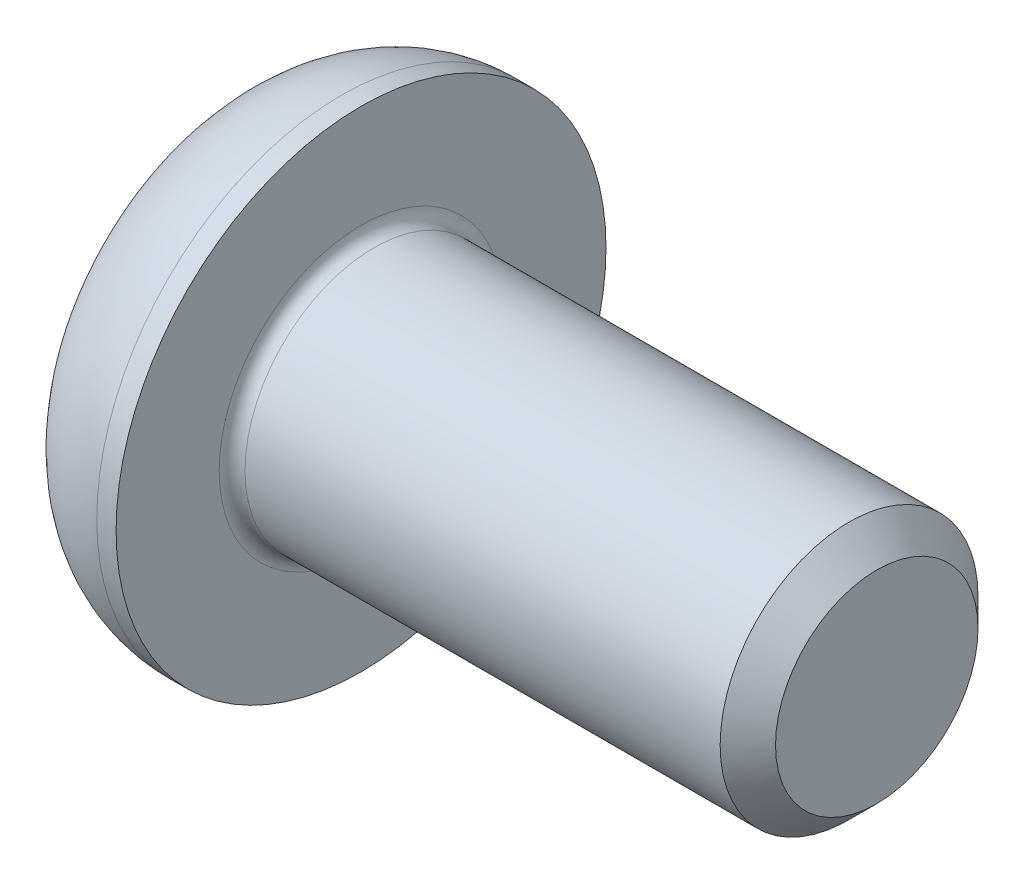
ISO-10303-21;
HEADER;
FILE_DESCRIPTION(('STEP AP214'),'2;1');
FILE_NAME('part.step','',(''),(''),'','','');
FILE_SCHEMA(('AUTOMOTIVE_DESIGN { 1 0 10303 214 1 1 1 1 }'));
ENDSEC;
DATA;
#1=APPLICATION_CONTEXT('core data for automotive mechanical design processes');
#2=APPLICATION_PROTOCOL_DEFINITION('international standard','automotive_design',2000,#1);
#3=PRODUCT_CONTEXT('',#1,'mechanical');
#4=PRODUCT('Part','Part','',(#3));
#5=PRODUCT_RELATED_PRODUCT_CATEGORY('part','',(#4));
#6=PRODUCT_DEFINITION_FORMATION('','',#4);
#7=PRODUCT_DEFINITION_CONTEXT('part definition',#1,'design');
#8=PRODUCT_DEFINITION('design','',#6,#7);
#9=PRODUCT_DEFINITION_SHAPE('','',#8);
#10=(LENGTH_UNIT() NAMED_UNIT(*) SI_UNIT(.MILLI.,.METRE.));
#11=(NAMED_UNIT(*) PLANE_ANGLE_UNIT() SI_UNIT($,.RADIAN.));
#12=(NAMED_UNIT(*) SI_UNIT($,.STERADIAN.) SOLID_ANGLE_UNIT());
#13=UNCERTAINTY_MEASURE_WITH_UNIT(LENGTH_MEASURE(1.E-05),#10,'distance_accuracy_value','');
#14=(GEOMETRIC_REPRESENTATION_CONTEXT(3) GLOBAL_UNCERTAINTY_ASSIGNED_CONTEXT((#13)) GLOBAL_UNIT_ASSIGNED_CONTEXT((#10,
#11,#12)) REPRESENTATION_CONTEXT('',''));
#15=CARTESIAN_POINT('',(0.,0.,0.));
#16=DIRECTION('',(0.,0.,1.));
#17=DIRECTION('',(1.,0.,0.));
#18=AXIS2_PLACEMENT_3D('',#15,#16,#17);
#19=CARTESIAN_POINT('',(-0.904999999875145,0.,0.));
#20=DIRECTION('',(-1.,0.,0.));
#21=DIRECTION('',(0.,0.,1.));
#22=AXIS2_PLACEMENT_3D('',#19,#20,#21);
#23=CONICAL_SURFACE('',#22,1.45203592671805,1.04719755115765);
#24=CARTESIAN_POINT('',(-0.0666666666973015,-5.6843418860808E-11,0.));
#25=VERTEX_POINT('',#24);
#26=VERTEX_LOOP('',#25);
#27=FACE_BOUND('',#26,.T.);
#28=CARTESIAN_POINT('',(-0.899999999895465,1.24999999991282,-0.721687836705776));
#29=CARTESIAN_POINT('',(-0.881684715662103,1.19507007013616,-0.753401646340966));
#30=CARTESIAN_POINT('',(-0.865027923174486,1.1396659860227,-0.785389209173815));
#31=CARTESIAN_POINT('',(-0.835953992139613,1.02789853317084,-0.84991817813204));
#32=CARTESIAN_POINT('',(-0.823547137724434,0.971533179187624,-0.882460730439183));
#33=CARTESIAN_POINT('',(-0.804234974358824,0.859500978788186,-0.947142551506237));
#34=CARTESIAN_POINT('',(-0.797201117271249,0.803851365133497,-0.979271870927009));
#35=CARTESIAN_POINT('',(-0.78880573011305,0.692290424620332,-1.04368160996113));
#36=CARTESIAN_POINT('',(-0.787437246268047,0.636379502977309,-1.07596179562322));
#37=CARTESIAN_POINT('',(-0.790291431384831,0.531915943877927,-1.13627385959031));
#38=CARTESIAN_POINT('',(-0.793813303298533,0.483347630813507,-1.16431478821198));
#39=CARTESIAN_POINT('',(-0.804973312984706,0.386527411401505,-1.22021396795239));
#40=CARTESIAN_POINT('',(-0.812615259263485,0.338275839679263,-1.24807202587511));
#41=CARTESIAN_POINT('',(-0.831718645861244,0.241256161485361,-1.30408636319712));
#42=CARTESIAN_POINT('',(-0.843261026405586,0.192500327968863,-1.33223555680244));
#43=CARTESIAN_POINT('',(-0.869457350530444,0.0957156438709913,-1.38811422021978));
#44=CARTESIAN_POINT('',(-0.884105142968317,0.0476855543224275,-1.41584440534985));
#45=CARTESIAN_POINT('',(-0.899999999989879,1.63995568404391E-10,-1.44337567287971));
#46=B_SPLINE_CURVE_WITH_KNOTS('',3,(#28,#29,#30,#31,#32,#33,#34,#35,#36,#37,#38,#39,#40,#41,#42,
#43,#44,#45),.UNSPECIFIED.,.F.,.F.,(4,2,2,2,2,2,2,2,4),(0.,0.198135007186097,0.396746135570628,
0.59044225374554,0.783900555431306,0.952317363947969,1.12089012085788,1.2932010137193,
1.4651737330377),.UNSPECIFIED.);
#47=CARTESIAN_POINT('',(-0.899999999950276,1.24999999980888,-0.721687836492175));
#48=VERTEX_POINT('',#47);
#49=CARTESIAN_POINT('',(-0.899999999982609,1.96257150938358E-12,-1.44337567286712));
#50=VERTEX_POINT('',#49);
#51=EDGE_CURVE('E103',#48,#50,#46,.T.);
#52=ORIENTED_EDGE('',*,*,#51,.T.);
#53=CARTESIAN_POINT('',(-0.899999999893595,-2.31072218817118E-10,-1.44337567300549));
#54=CARTESIAN_POINT('',(-0.881684715660365,-0.0549299299140426,-1.41166186320821));
#55=CARTESIAN_POINT('',(-0.86502792317278,-0.110334013989012,-1.3796743003089));
#56=CARTESIAN_POINT('',(-0.835953992137871,-0.222101466812513,-1.31514533130202));
#57=CARTESIAN_POINT('',(-0.823547137722625,-0.278466820805983,-1.28260277901289));
#58=CARTESIAN_POINT('',(-0.804234974356904,-0.390499021212521,-1.21792095795876));
#59=CARTESIAN_POINT('',(-0.797201117269277,-0.446148634864375,-1.18579163853346));
#60=CARTESIAN_POINT('',(-0.788805730110948,-0.557709575375265,-1.12138189949618));
#61=CARTESIAN_POINT('',(-0.787437246265866,-0.613620497018845,-1.08910171383544));
#62=CARTESIAN_POINT('',(-0.790291431382727,-0.718084056126904,-1.02878964986439));
#63=CARTESIAN_POINT('',(-0.793813303297357,-0.766652369199541,-1.00074872123762));
#64=CARTESIAN_POINT('',(-0.804973312986761,-0.863472588628037,-0.944849541487422));
#65=CARTESIAN_POINT('',(-0.812615259267848,-0.911724160358555,-0.916991483560017));
#66=CARTESIAN_POINT('',(-0.831718645871401,-1.00874383856915,-0.860977146228447));
#67=CARTESIAN_POINT('',(-0.843261026419272,-1.05749967209406,-0.832827952618252));
#68=CARTESIAN_POINT('',(-0.869457350551973,-1.15428435620845,-0.776949289191331));
#69=CARTESIAN_POINT('',(-0.884105142994157,-1.20231444576512,-0.749219104056564));
#70=CARTESIAN_POINT('',(-0.90000000002026,-1.24999999993156,-0.721687836522116));
#71=B_SPLINE_CURVE_WITH_KNOTS('',3,(#53,#54,#55,#56,#57,#58,#59,#60,#61,#62,#63,#64,#65,#66,#67,
#68,#69,#70),.UNSPECIFIED.,.F.,.F.,(4,2,2,2,2,2,2,2,4),(0.,0.198135007185751,0.396746135569964,
0.590442253744319,0.783900555429511,0.952317363975204,1.12089012091425,1.29320101380634,
1.46517373315516),.UNSPECIFIED.);
#72=CARTESIAN_POINT('',(-0.899999999987108,-1.24999999995633,-0.721687836364369));
#73=VERTEX_POINT('',#72);
#74=EDGE_CURVE('E134',#50,#73,#71,.T.);
#75=ORIENTED_EDGE('',*,*,#74,.T.);
#76=CARTESIAN_POINT('',(-0.899999999842174,-1.25000000019539,-0.721687836229798));
#77=CARTESIAN_POINT('',(-0.882896111075563,-1.24999999481034,-0.662444421267075));
#78=CARTESIAN_POINT('',(-0.867237014060793,-1.24999999738598,-0.602732338419685));
#79=CARTESIAN_POINT('',(-0.839561502195528,-1.25000000261982,-0.482338189350465));
#80=CARTESIAN_POINT('',(-0.827553237744171,-1.25000000527818,-0.421654266620353));
#81=CARTESIAN_POINT('',(-0.80824250364639,-1.24999999484458,-0.300967350520173));
#82=CARTESIAN_POINT('',(-0.800837076879798,-1.24999998211752,-0.240981348930731));
#83=CARTESIAN_POINT('',(-0.790895700381869,-1.25000001786304,-0.12066326676355));
#84=CARTESIAN_POINT('',(-0.788354464927657,-1.25000006626909,-0.0603316333839474));
#85=CARTESIAN_POINT('',(-0.788354464927002,-1.25000006626979,0.0603316333939961));
#86=CARTESIAN_POINT('',(-0.790895700382119,-1.25000001786444,0.120663266792337));
#87=CARTESIAN_POINT('',(-0.800837076887306,-1.24999998211612,0.240981348995787));
#88=CARTESIAN_POINT('',(-0.808242503660248,-1.24999999483968,0.30096735060276));
#89=CARTESIAN_POINT('',(-0.827553237762847,-1.25000000528321,0.421654266741162));
#90=CARTESIAN_POINT('',(-0.839561502212521,-1.25000000263868,0.48233818949201));
#91=CARTESIAN_POINT('',(-0.867237014115977,-1.24999999736716,0.602732338592252));
#92=CARTESIAN_POINT('',(-0.882896111170561,-1.24999999474013,0.662444421449944));
#93=CARTESIAN_POINT('',(-0.900000000022398,-1.25,0.72168783641098));
#94=B_SPLINE_CURVE_WITH_KNOTS('',3,(#76,#77,#78,#79,#80,#81,#82,#83,#84,#85,#86,#87,#88,#89,#90,
#91,#92,#93),.UNSPECIFIED.,.F.,.F.,(4,2,2,2,2,2,2,2,4),(0.,0.185045871632975,0.3705018706702,
0.551644291266182,0.732589759614196,0.913535228017753,1.09467764866905,1.28013364776468,
1.46517951945754),.UNSPECIFIED.);
#95=CARTESIAN_POINT('',(-0.899999999988181,-1.24999999987475,0.721687836509393));
#96=VERTEX_POINT('',#95);
#97=EDGE_CURVE('E274',#73,#96,#94,.T.);
#98=ORIENTED_EDGE('',*,*,#97,.T.);
#99=CARTESIAN_POINT('',(-0.899999999842517,-1.24999999987697,0.72168783678411));
#100=CARTESIAN_POINT('',(-0.881684715631303,-1.19507007008352,0.753401646392062));
#101=CARTESIAN_POINT('',(-0.865027923154306,-1.13966598596531,0.785389209212495));
#102=CARTESIAN_POINT('',(-0.835953992130203,-1.02789853311445,0.849918178159034));
#103=CARTESIAN_POINT('',(-0.823547137715168,-0.971533179136998,0.88246073046694));
#104=CARTESIAN_POINT('',(-0.804234974352029,-0.859500978745731,0.947142551532184));
#105=CARTESIAN_POINT('',(-0.797201117266771,-0.803851365093511,0.979271870950477));
#106=CARTESIAN_POINT('',(-0.78880573011195,-0.692290424586258,1.04368160998042));
#107=CARTESIAN_POINT('',(-0.787437246267998,-0.636379502946676,1.07596179564081));
#108=CARTESIAN_POINT('',(-0.79029143138629,-0.531915943852794,1.1362738596049));
#109=CARTESIAN_POINT('',(-0.793813303300584,-0.483347630790453,1.16431478822531));
#110=CARTESIAN_POINT('',(-0.804973312987493,-0.386527411382594,1.22021396796329));
#111=CARTESIAN_POINT('',(-0.812615259266423,-0.338275839662417,1.24807202588483));
#112=CARTESIAN_POINT('',(-0.831718645864065,-0.241256161473001,1.30408636320426));
#113=CARTESIAN_POINT('',(-0.843261026408104,-0.192500327958919,1.33223555680818));
#114=CARTESIAN_POINT('',(-0.869457350531995,-0.0957156438659012,1.38811422022272));
#115=CARTESIAN_POINT('',(-0.8841051429692,-0.0476855543197738,1.41584440535138));
#116=CARTESIAN_POINT('',(-0.899999999989963,-1.63745370551762E-10,1.44337567287986));
#117=B_SPLINE_CURVE_WITH_KNOTS('',3,(#99,#100,#101,#102,#103,#104,#105,#106,#107,#108,#109,#110,
#111,#112,#113,#114,#115,#116),.UNSPECIFIED.,.F.,.F.,(4,2,2,2,2,2,2,2,4),(0.,0.198135007172041,
0.396746135543351,0.590442253707212,0.783900555381576,0.952317363891064,1.120890120794,
1.29320101364705,1.4651737329568),.UNSPECIFIED.);
#118=CARTESIAN_POINT('',(-0.899999999982609,-1.69922761891508E-12,1.44337567286712));
#119=VERTEX_POINT('',#118);
#120=EDGE_CURVE('E269',#96,#119,#117,.T.);
#121=ORIENTED_EDGE('',*,*,#120,.T.);
#122=CARTESIAN_POINT('',(-0.899999999893449,2.31368758154919E-10,1.44337567300543));
#123=CARTESIAN_POINT('',(-0.881684715660276,0.0549299299142771,1.41166186320811));
#124=CARTESIAN_POINT('',(-0.865027923172723,0.110334013989197,1.3796743003088));
#125=CARTESIAN_POINT('',(-0.835953992137855,0.222101466812606,1.31514533130196));
#126=CARTESIAN_POINT('',(-0.823547137722618,0.278466820806033,1.28260277901286));
#127=CARTESIAN_POINT('',(-0.804234974356898,0.390499021212549,1.21792095795875));
#128=CARTESIAN_POINT('',(-0.79720111726927,0.446148634864426,1.18579163853343));
#129=CARTESIAN_POINT('',(-0.788805730110944,0.557709575375368,1.12138189949612));
#130=CARTESIAN_POINT('',(-0.787437246265865,0.613620497018976,1.08910171383536));
#131=CARTESIAN_POINT('',(-0.790291431382515,0.718084056119022,1.02878964986894));
#132=CARTESIAN_POINT('',(-0.793813303296201,0.766652369183635,1.00074872124681));
#133=CARTESIAN_POINT('',(-0.804973312982414,0.863472588596216,0.944849541505793));
#134=CARTESIAN_POINT('',(-0.81261525926125,0.911724160318843,0.916991483582945));
#135=CARTESIAN_POINT('',(-0.831718645859188,1.00874383851348,0.860977146260592));
#136=CARTESIAN_POINT('',(-0.843261026403653,1.05749967203032,0.832827952655053));
#137=CARTESIAN_POINT('',(-0.869457350528802,1.15428435612887,0.776949289237277));
#138=CARTESIAN_POINT('',(-0.884105142966843,1.20231444567776,0.749219104106998));
#139=CARTESIAN_POINT('',(-0.899999999988587,1.24999999983654,0.721687836576975));
#140=B_SPLINE_CURVE_WITH_KNOTS('',3,(#122,#123,#124,#125,#126,#127,#128,#129,#130,#131,#132,
#133,#134,#135,#136,#137,#138,#139),.UNSPECIFIED.,.F.,.F.,(4,2,2,2,2,2,2,2,4),(0.,
0.198135007185603,0.396746135569654,0.590442253744091,0.783900555429375,0.952317363947233,
1.12089012085834,1.29320101372104,1.4651737330407),.UNSPECIFIED.);
#141=CARTESIAN_POINT('',(-0.899999999982482,1.24999999990819,0.721687836431727));
#142=VERTEX_POINT('',#141);
#143=EDGE_CURVE('E106',#119,#142,#140,.T.);
#144=ORIENTED_EDGE('',*,*,#143,.T.);
#145=CARTESIAN_POINT('',(-0.899999999895439,1.25000000014505,0.721687836300142));
#146=CARTESIAN_POINT('',(-0.882896111105858,1.24999999479226,0.662444421335814));
#147=CARTESIAN_POINT('',(-0.867237014079879,1.24999999738113,0.6027323384837));
#148=CARTESIAN_POINT('',(-0.83956150220309,1.25000000262467,0.482338189402405));
#149=CARTESIAN_POINT('',(-0.827553237751427,1.25000000527947,0.42165426666494));
#150=CARTESIAN_POINT('',(-0.808242503651249,1.24999999484333,0.300967350551273));
#151=CARTESIAN_POINT('',(-0.800837076882572,1.24999998211718,0.240981348955692));
#152=CARTESIAN_POINT('',(-0.790895700382171,1.25000001786337,0.120663266775804));
#153=CARTESIAN_POINT('',(-0.788354464927581,1.25000006626918,0.0603316333896348));
#154=CARTESIAN_POINT('',(-0.788354464927077,1.2500000662697,-0.0603316333854344));
#155=CARTESIAN_POINT('',(-0.79089570038138,1.25000001786441,-0.120663266774334));
#156=CARTESIAN_POINT('',(-0.800837076883513,1.24999998211614,-0.240981348958975));
#157=CARTESIAN_POINT('',(-0.808242503654205,1.24999999483968,-0.300967350556579));
#158=CARTESIAN_POINT('',(-0.82755323775111,1.2500000052832,-0.421654266676448));
#159=CARTESIAN_POINT('',(-0.839561502197323,1.25000000263867,-0.482338189418136));
#160=CARTESIAN_POINT('',(-0.867237014093116,1.24999999736716,-0.602732338500565));
#161=CARTESIAN_POINT('',(-0.882896111143514,1.24999999474014,-0.662444421349601));
#162=CARTESIAN_POINT('',(-0.89999999999097,1.25,-0.721687836302114));
#163=B_SPLINE_CURVE_WITH_KNOTS('',3,(#145,#146,#147,#148,#149,#150,#151,#152,#153,#154,#155,
#156,#157,#158,#159,#160,#161,#162),.UNSPECIFIED.,.F.,.F.,(4,2,2,2,2,2,2,2,4),(0.,
0.185045871655127,0.370501870713738,0.551644291328948,0.732589759696517,0.913535228071817,
1.09467764869446,1.28013364776116,1.46517951942576),.UNSPECIFIED.);
#164=EDGE_CURVE('E99',#142,#48,#163,.T.);
#165=ORIENTED_EDGE('',*,*,#164,.T.);
#166=EDGE_LOOP('',(#52,#75,#98,#121,#144,#165));
#167=FACE_BOUND('',#166,.T.);
#168=ADVANCED_FACE('F17',(#27,#167),#23,.F.);
#169=CARTESIAN_POINT('',(-2.2,1.25,0.721687836487));
#170=DIRECTION('',(0.,1.,0.));
#171=DIRECTION('',(0.,0.,1.));
#172=AXIS2_PLACEMENT_3D('',#169,#170,#171);
#173=PLANE('',#172);
#174=ORIENTED_EDGE('',*,*,#164,.F.);
#175=DIRECTION('',(1.,0.,0.));
#176=VECTOR('',#175,1.);
#177=CARTESIAN_POINT('',(-2.2,1.2499999999981,0.721687836483702));
#178=LINE('',#177,#176);
#179=CARTESIAN_POINT('',(-2.2,1.24999999978205,0.721687836484204));
#180=VERTEX_POINT('',#179);
#181=EDGE_CURVE('E109',#142,#180,#178,.F.);
#182=ORIENTED_EDGE('',*,*,#181,.T.);
#183=DIRECTION('',(0.,0.,1.));
#184=VECTOR('',#183,1.);
#185=CARTESIAN_POINT('',(-2.2,1.24999999954,0.));
#186=LINE('',#185,#184);
#187=CARTESIAN_POINT('',(-2.2,1.24999999961776,-0.721687836707686));
#188=VERTEX_POINT('',#187);
#189=EDGE_CURVE('E115',#188,#180,#186,.T.);
#190=ORIENTED_EDGE('',*,*,#189,.F.);
#191=DIRECTION('',(1.,0.,0.));
#192=VECTOR('',#191,1.);
#193=CARTESIAN_POINT('',(-2.2,1.24999999961776,-0.721687836707686));
#194=LINE('',#193,#192);
#195=EDGE_CURVE('E112',#188,#48,#194,.T.);
#196=ORIENTED_EDGE('',*,*,#195,.T.);
#197=EDGE_LOOP('',(#174,#182,#190,#196));
#198=FACE_BOUND('',#197,.T.);
#199=ADVANCED_FACE('F113',(#198),#173,.F.);
#200=CARTESIAN_POINT('',(-2.2,0.,1.44337567297));
#201=DIRECTION('',(0.,0.50000000000019,0.866025403784329));
#202=DIRECTION('',(0.,-0.866025403784329,0.50000000000019));
#203=AXIS2_PLACEMENT_3D('',#200,#201,#202);
#204=PLANE('',#203);
#205=DIRECTION('',(1.,0.,0.));
#206=VECTOR('',#205,1.);
#207=CARTESIAN_POINT('',(-2.2,-1.90407585531904E-12,1.4433756729733));
#208=LINE('',#207,#206);
#209=CARTESIAN_POINT('',(-2.2,-1.83056522522186E-10,1.44337567308873));
#210=VERTEX_POINT('',#209);
#211=EDGE_CURVE('E267',#119,#210,#208,.F.);
#212=ORIENTED_EDGE('',*,*,#211,.T.);
#213=DIRECTION('',(0.,-0.866025403757106,0.500000000047341));
#214=VECTOR('',#213,1.);
#215=CARTESIAN_POINT('',(-2.2,1.24999999954,0.721687836573));
#216=LINE('',#215,#214);
#217=EDGE_CURVE('E123',#180,#210,#216,.T.);
#218=ORIENTED_EDGE('',*,*,#217,.F.);
#219=ORIENTED_EDGE('',*,*,#181,.F.);
#220=ORIENTED_EDGE('',*,*,#143,.F.);
#221=EDGE_LOOP('',(#212,#218,#219,#220));
#222=FACE_BOUND('',#221,.T.);
#223=ADVANCED_FACE('F397',(#222),#204,.F.);
#224=CARTESIAN_POINT('',(-2.2,-1.25,0.721687836487));
#225=DIRECTION('',(0.,-0.50000000000019,0.866025403784329));
#226=DIRECTION('',(0.,-0.866025403784329,-0.50000000000019));
#227=AXIS2_PLACEMENT_3D('',#224,#225,#226);
#228=PLANE('',#227);
#229=DIRECTION('',(1.,0.,0.));
#230=VECTOR('',#229,1.);
#231=CARTESIAN_POINT('',(-2.2,-1.25,0.721687836658));
#232=LINE('',#231,#230);
#233=CARTESIAN_POINT('',(-2.2,-1.25000000023,0.721687836560204));
#234=VERTEX_POINT('',#233);
#235=EDGE_CURVE('E272',#96,#234,#232,.F.);
#236=ORIENTED_EDGE('',*,*,#235,.T.);
#237=DIRECTION('',(0.,-0.86602540375779,-0.500000000046157));
#238=VECTOR('',#237,1.);
#239=CARTESIAN_POINT('',(-2.2,-4.58026845617798E-10,1.44337567315));
#240=LINE('',#239,#238);
#241=EDGE_CURVE('E240',#210,#234,#240,.T.);
#242=ORIENTED_EDGE('',*,*,#241,.F.);
#243=ORIENTED_EDGE('',*,*,#211,.F.);
#244=ORIENTED_EDGE('',*,*,#120,.F.);
#245=EDGE_LOOP('',(#236,#242,#243,#244));
#246=FACE_BOUND('',#245,.T.);
#247=ADVANCED_FACE('F389',(#246),#228,.F.);
#248=CARTESIAN_POINT('',(-2.2,-1.25,-0.721687836487));
#249=DIRECTION('',(0.,-1.,0.));
#250=DIRECTION('',(1.,0.,0.));
#251=AXIS2_PLACEMENT_3D('',#248,#249,#250);
#252=PLANE('',#251);
#253=ORIENTED_EDGE('',*,*,#97,.F.);
#254=DIRECTION('',(1.,0.,0.));
#255=VECTOR('',#254,1.);
#256=CARTESIAN_POINT('',(-2.2,-1.2500000001474,-0.7216878363975));
#257=LINE('',#256,#255);
#258=CARTESIAN_POINT('',(-2.2,-1.25000000019764,-0.721687836546482));
#259=VERTEX_POINT('',#258);
#260=EDGE_CURVE('E277',#73,#259,#257,.F.);
#261=ORIENTED_EDGE('',*,*,#260,.T.);
#262=DIRECTION('',(0.,0.,1.));
#263=VECTOR('',#262,1.);
#264=CARTESIAN_POINT('',(-2.2,-1.25000000046,0.));
#265=LINE('',#264,#263);
#266=EDGE_CURVE('E245',#234,#259,#265,.F.);
#267=ORIENTED_EDGE('',*,*,#266,.F.);
#268=ORIENTED_EDGE('',*,*,#235,.F.);
#269=EDGE_LOOP('',(#253,#261,#267,#268));
#270=FACE_BOUND('',#269,.T.);
#271=ADVANCED_FACE('F382',(#270),#252,.F.);
#272=CARTESIAN_POINT('',(-2.2,0.,-1.44337567297));
#273=DIRECTION('',(0.,-0.50000000000019,-0.866025403784329));
#274=DIRECTION('',(0.,0.866025403784329,-0.50000000000019));
#275=AXIS2_PLACEMENT_3D('',#272,#273,#274);
#276=PLANE('',#275);
#277=DIRECTION('',(1.,0.,0.));
#278=VECTOR('',#277,1.);
#279=CARTESIAN_POINT('',(-2.2,1.90385901488455E-12,-1.4433756729733));
#280=LINE('',#279,#278);
#281=CARTESIAN_POINT('',(-2.2,-1.03210382275768E-10,-1.44337567298957));
#282=VERTEX_POINT('',#281);
#283=EDGE_CURVE('E119',#50,#282,#280,.F.);
#284=ORIENTED_EDGE('',*,*,#283,.T.);
#285=DIRECTION('',(0.,0.86602540375779,-0.500000000046157));
#286=VECTOR('',#285,1.);
#287=CARTESIAN_POINT('',(-2.2,-1.25000000046,-0.721687836573));
#288=LINE('',#287,#286);
#289=EDGE_CURVE('E250',#259,#282,#288,.T.);
#290=ORIENTED_EDGE('',*,*,#289,.F.);
#291=ORIENTED_EDGE('',*,*,#260,.F.);
#292=ORIENTED_EDGE('',*,*,#74,.F.);
#293=EDGE_LOOP('',(#284,#290,#291,#292));
#294=FACE_BOUND('',#293,.T.);
#295=ADVANCED_FACE('F376',(#294),#276,.F.);
#296=CARTESIAN_POINT('',(-2.2,1.25,-0.721687836487));
#297=DIRECTION('',(0.,0.50000000000019,-0.866025403784329));
#298=DIRECTION('',(0.,0.866025403784329,0.50000000000019));
#299=AXIS2_PLACEMENT_3D('',#296,#297,#298);
#300=PLANE('',#299);
#301=ORIENTED_EDGE('',*,*,#195,.F.);
#302=DIRECTION('',(0.,0.866025403757106,0.500000000047341));
#303=VECTOR('',#302,1.);
#304=CARTESIAN_POINT('',(-2.2,-4.58026845617798E-10,-1.44337567315));
#305=LINE('',#304,#303);
#306=EDGE_CURVE('E255',#282,#188,#305,.T.);
#307=ORIENTED_EDGE('',*,*,#306,.F.);
#308=ORIENTED_EDGE('',*,*,#283,.F.);
#309=ORIENTED_EDGE('',*,*,#51,.F.);
#310=EDGE_LOOP('',(#301,#307,#308,#309));
#311=FACE_BOUND('',#310,.T.);
#312=ADVANCED_FACE('F121',(#311),#300,.F.);
#313=CARTESIAN_POINT('',(-2.2,2.62168783649,0.));
#314=DIRECTION('',(-1.,0.,0.));
#315=DIRECTION('',(0.,-1.,0.));
#316=AXIS2_PLACEMENT_3D('',#313,#314,#315);
#317=PLANE('',#316);
#318=ORIENTED_EDGE('',*,*,#289,.T.);
#319=ORIENTED_EDGE('',*,*,#306,.T.);
#320=ORIENTED_EDGE('',*,*,#189,.T.);
#321=ORIENTED_EDGE('',*,*,#217,.T.);
#322=ORIENTED_EDGE('',*,*,#241,.T.);
#323=ORIENTED_EDGE('',*,*,#266,.T.);
#324=EDGE_LOOP('',(#318,#319,#320,#321,#322,#323));
#325=FACE_BOUND('',#324,.T.);
#326=CARTESIAN_POINT('',(-2.2,0.,-1.9));
#327=CARTESIAN_POINT('',(-2.2,-0.36265690061289,-1.89979752619059));
#328=CARTESIAN_POINT('',(-2.2,-0.699379948167787,-1.76659777201864));
#329=CARTESIAN_POINT('',(-2.2,-1.06480278954368,-1.62204505133757));
#330=CARTESIAN_POINT('',(-2.2,-1.34350288425459,-1.34350288425459));
#331=CARTESIAN_POINT('',(-2.2,-1.6214575775046,-1.06570569624483));
#332=CARTESIAN_POINT('',(-2.2,-1.76659777201864,-0.699379948167787));
#333=CARTESIAN_POINT('',(-2.2,-1.89979722746393,-0.363191958873555));
#334=CARTESIAN_POINT('',(-2.2,-1.9,0.));
#335=B_SPLINE_CURVE_WITH_KNOTS('',2,(#326,#327,#328,#329,#330,#331,#332,#333,#334),
.UNSPECIFIED.,.F.,.F.,(3,2,2,2,3),(0.,0.25,0.5,0.75,1.),.UNSPECIFIED.);
#336=CARTESIAN_POINT('',(-2.2,0.,-1.9));
#337=VERTEX_POINT('',#336);
#338=CARTESIAN_POINT('',(-2.2,-1.9,0.));
#339=VERTEX_POINT('',#338);
#340=EDGE_CURVE('E287',#337,#339,#335,.T.);
#341=ORIENTED_EDGE('',*,*,#340,.T.);
#342=CARTESIAN_POINT('',(-2.2,-1.9,0.));
#343=CARTESIAN_POINT('',(-2.2,-1.89979752619059,0.362656900612583));
#344=CARTESIAN_POINT('',(-2.2,-1.76659777201864,0.699379948167787));
#345=CARTESIAN_POINT('',(-2.2,-1.62204505133753,1.06480278954412));
#346=CARTESIAN_POINT('',(-2.2,-1.34350288425459,1.34350288425459));
#347=CARTESIAN_POINT('',(-2.2,-1.06570569624445,1.62145757750459));
#348=CARTESIAN_POINT('',(-2.2,-0.699379948167787,1.76659777201864));
#349=CARTESIAN_POINT('',(-2.2,-0.36319195887394,1.89979722746393));
#350=CARTESIAN_POINT('',(-2.2,0.,1.9));
#351=B_SPLINE_CURVE_WITH_KNOTS('',2,(#342,#343,#344,#345,#346,#347,#348,#349,#350),
.UNSPECIFIED.,.F.,.F.,(3,2,2,2,3),(0.,0.25,0.5,0.75,1.),.UNSPECIFIED.);
#352=CARTESIAN_POINT('',(-2.2,0.,1.9));
#353=VERTEX_POINT('',#352);
#354=EDGE_CURVE('E284',#339,#353,#351,.T.);
#355=ORIENTED_EDGE('',*,*,#354,.T.);
#356=CARTESIAN_POINT('',(-2.2,0.,1.9));
#357=CARTESIAN_POINT('',(-2.2,0.362656900612794,1.89979752619059));
#358=CARTESIAN_POINT('',(-2.2,0.699379948167786,1.76659777201864));
#359=CARTESIAN_POINT('',(-2.2,1.06480278954374,1.62204505133758));
#360=CARTESIAN_POINT('',(-2.2,1.34350288425459,1.34350288425459));
#361=CARTESIAN_POINT('',(-2.2,1.62145757750463,1.06570569624472));
#362=CARTESIAN_POINT('',(-2.2,1.76659777201864,0.699379948167782));
#363=CARTESIAN_POINT('',(-2.2,1.89979722746393,0.363191958873572));
#364=CARTESIAN_POINT('',(-2.2,1.9,0.));
#365=B_SPLINE_CURVE_WITH_KNOTS('',2,(#356,#357,#358,#359,#360,#361,#362,#363,#364),
.UNSPECIFIED.,.F.,.F.,(3,2,2,2,3),(0.,0.25,0.5,0.75,1.),.UNSPECIFIED.);
#366=CARTESIAN_POINT('',(-2.2,1.9,0.));
#367=VERTEX_POINT('',#366);
#368=EDGE_CURVE('E259',#353,#367,#365,.T.);
#369=ORIENTED_EDGE('',*,*,#368,.T.);
#370=CARTESIAN_POINT('',(-2.2,1.9,0.));
#371=CARTESIAN_POINT('',(-2.2,1.89979752619059,-0.36265690061314));
#372=CARTESIAN_POINT('',(-2.2,1.76659777201864,-0.699379948167792));
#373=CARTESIAN_POINT('',(-2.2,1.62204505133735,-1.06480278954399));
#374=CARTESIAN_POINT('',(-2.2,1.34350288425459,-1.34350288425459));
#375=CARTESIAN_POINT('',(-2.2,1.06570569624542,-1.62145757750393));
#376=CARTESIAN_POINT('',(-2.2,0.699379948167788,-1.76659777201864));
#377=CARTESIAN_POINT('',(-2.2,0.363191958874567,-1.89979722746393));
#378=CARTESIAN_POINT('',(-2.2,0.,-1.9));
#379=B_SPLINE_CURVE_WITH_KNOTS('',2,(#370,#371,#372,#373,#374,#375,#376,#377,#378),
.UNSPECIFIED.,.F.,.F.,(3,2,2,2,3),(0.,0.25,0.5,0.75,1.),.UNSPECIFIED.);
#380=EDGE_CURVE('E305',#367,#337,#379,.T.);
#381=ORIENTED_EDGE('',*,*,#380,.T.);
#382=EDGE_LOOP('',(#341,#355,#369,#381));
#383=FACE_BOUND('',#382,.T.);
#384=ADVANCED_FACE('F290',(#325,#383),#317,.T.);
#385=CARTESIAN_POINT('',(-0.3,0.,0.));
#386=DIRECTION('',(1.,0.,0.));
#387=DIRECTION('',(0.,0.,-1.));
#388=AXIS2_PLACEMENT_3D('',#385,#386,#387);
#389=DEGENERATE_TOROIDAL_SURFACE('',#388,1.9,1.90000000000007,.T.);
#390=CARTESIAN_POINT('',(-0.3,0.,0.));
#391=DIRECTION('',(1.,0.,0.));
#392=DIRECTION('',(0.,0.,-1.));
#393=AXIS2_PLACEMENT_3D('',#390,#391,#392);
#394=CIRCLE('',#393,3.8);
#395=CARTESIAN_POINT('',(-0.3,0.,-3.8));
#396=VERTEX_POINT('',#395);
#397=EDGE_CURVE('E308',#396,#396,#394,.T.);
#398=ORIENTED_EDGE('',*,*,#397,.F.);
#399=EDGE_LOOP('',(#398));
#400=FACE_BOUND('',#399,.T.);
#401=ORIENTED_EDGE('',*,*,#380,.F.);
#402=ORIENTED_EDGE('',*,*,#368,.F.);
#403=ORIENTED_EDGE('',*,*,#354,.F.);
#404=ORIENTED_EDGE('',*,*,#340,.F.);
#405=EDGE_LOOP('',(#401,#402,#403,#404));
#406=FACE_BOUND('',#405,.T.);
#407=ADVANCED_FACE('F19',(#400,#406),#389,.T.);
#408=CARTESIAN_POINT('',(-1.1,0.,0.));
#409=DIRECTION('',(1.,0.,0.));
#410=DIRECTION('',(0.,0.,-1.));
#411=AXIS2_PLACEMENT_3D('',#408,#409,#410);
#412=CYLINDRICAL_SURFACE('',#411,3.8);
#413=ORIENTED_EDGE('',*,*,#397,.T.);
#414=EDGE_LOOP('',(#413));
#415=FACE_BOUND('',#414,.T.);
#416=CARTESIAN_POINT('',(0.,0.,0.));
#417=DIRECTION('',(1.,0.,0.));
#418=DIRECTION('',(0.,0.,-1.));
#419=AXIS2_PLACEMENT_3D('',#416,#417,#418);
#420=CIRCLE('',#419,3.8);
#421=CARTESIAN_POINT('',(0.,0.,-3.8));
#422=VERTEX_POINT('',#421);
#423=EDGE_CURVE('E132',#422,#422,#420,.T.);
#424=ORIENTED_EDGE('',*,*,#423,.F.);
#425=EDGE_LOOP('',(#424));
#426=FACE_BOUND('',#425,.T.);
#427=ADVANCED_FACE('F201',(#415,#426),#412,.T.);
#428=CARTESIAN_POINT('',(0.,2.9,0.));
#429=DIRECTION('',(1.,0.,0.));
#430=DIRECTION('',(0.,1.,0.));
#431=AXIS2_PLACEMENT_3D('',#428,#429,#430);
#432=PLANE('',#431);
#433=CARTESIAN_POINT('',(0.,0.,0.));
#434=DIRECTION('',(1.,0.,0.));
#435=DIRECTION('',(0.,0.,1.));
#436=AXIS2_PLACEMENT_3D('',#433,#434,#435);
#437=CIRCLE('',#436,2.2);
#438=CARTESIAN_POINT('',(0.,-2.2,0.));
#439=VERTEX_POINT('',#438);
#440=CARTESIAN_POINT('',(0.,0.,2.2));
#441=VERTEX_POINT('',#440);
#442=EDGE_CURVE('E219',#439,#441,#437,.F.);
#443=ORIENTED_EDGE('',*,*,#442,.T.);
#444=CARTESIAN_POINT('',(0.,2.2,0.));
#445=CARTESIAN_POINT('',(2.59485219284629E-09,2.19998575154874,0.0307475517317676));
#446=CARTESIAN_POINT('',(1.81769915502313E-09,2.19933455898998,0.0614948549161519));
#447=CARTESIAN_POINT('',(-1.18157776646753E-10,2.19676157840836,0.122934729205102));
#448=CARTESIAN_POINT('',(-1.27684271321729E-09,2.19483985351,0.153627302952858));
#449=CARTESIAN_POINT('',(2.38564244641518E-09,2.18972916496953,0.214905757204253));
#450=CARTESIAN_POINT('',(7.206658026358E-09,2.18654023407363,0.245491640444308));
#451=CARTESIAN_POINT('',(4.27781037659395E-08,2.17889884798254,0.306505997739295));
#452=CARTESIAN_POINT('',(7.35284820468544E-08,2.17444639531538,0.336934472109042));
#453=CARTESIAN_POINT('',(1.73591454626332E-07,2.16683112781648,0.38241870801543));
#454=CARTESIAN_POINT('',(2.15937663297943E-07,2.164136501512,0.397554210627282));
#455=CARTESIAN_POINT('',(3.11082697393704E-07,2.15843235202415,0.427741458892821));
#456=CARTESIAN_POINT('',(3.63865186029653E-07,2.15542332442782,0.442793298123176));
#457=CARTESIAN_POINT('',(4.98662459445389E-07,2.14590969967549,0.487844204128152));
#458=CARTESIAN_POINT('',(5.57143956349478E-07,2.13891800198918,0.51774201553623));
#459=CARTESIAN_POINT('',(5.8019872945562E-07,2.12365058896836,0.577202730744742));
#460=CARTESIAN_POINT('',(5.44782594325254E-07,2.11537501851295,0.606765671930331));
#461=CARTESIAN_POINT('',(3.95827864921428E-07,2.09757534103425,0.66550932321324));
#462=CARTESIAN_POINT('',(2.82302068252502E-07,2.0880514387464,0.694690095127757));
#463=CARTESIAN_POINT('',(9.51522408654276E-08,2.06769565514402,0.75258394329037));
#464=CARTESIAN_POINT('',(2.15196427181802E-08,2.05686405528101,0.781297118673312));
#465=CARTESIAN_POINT('',(-1.30858420915561E-08,2.03864474828845,0.827145712723559));
#466=CARTESIAN_POINT('',(-6.90180738172412E-09,2.03157101672207,0.844408395369794));
#467=CARTESIAN_POINT('',(2.18093351978141E-08,2.00213373394309,0.913762935807425));
#468=CARTESIAN_POINT('',(5.19555766989616E-08,1.97799447356219,0.965125009730387));
#469=CARTESIAN_POINT('',(2.14150389549838E-07,1.93895336641498,1.04046425938531));
#470=CARTESIAN_POINT('',(2.87289391207069E-07,1.92551544493197,1.06521630024549));
#471=CARTESIAN_POINT('',(4.36733867951727E-07,1.89560156299219,1.11785037861587));
#472=CARTESIAN_POINT('',(5.11872967725794E-07,1.87897202391597,1.1456459737916));
#473=CARTESIAN_POINT('',(5.72744867038476E-07,1.85428340649297,1.18487768253396));
#474=CARTESIAN_POINT('',(5.85020363811831E-07,1.84672549558327,1.19663240914968));
#475=CARTESIAN_POINT('',(5.9812196358566E-07,1.8299215577809,1.2222176966298));
#476=CARTESIAN_POINT('',(5.96322010240175E-07,1.82062818382307,1.23601720150462));
#477=CARTESIAN_POINT('',(5.76338004342574E-07,1.79227906739977,1.27708907650998));
#478=CARTESIAN_POINT('',(5.43573036455675E-07,1.77275210116351,1.30403837564686));
#479=CARTESIAN_POINT('',(4.44114124755134E-07,1.73248190795096,1.35700609597222));
#480=CARTESIAN_POINT('',(3.77423598116247E-07,1.71173880365716,1.38302461063215));
#481=CARTESIAN_POINT('',(2.34286813252623E-07,1.66909325013756,1.43408936194957));
#482=CARTESIAN_POINT('',(1.5784177283406E-07,1.64719094583199,1.45913571946822));
#483=CARTESIAN_POINT('',(4.54228323956821E-08,1.60222702315862,1.50815793972183));
#484=CARTESIAN_POINT('',(9.44291421200319E-09,1.57916557771687,1.53213396113274));
#485=CARTESIAN_POINT('',(-4.87653383578462E-09,1.54348315572177,1.56777134290827));
#486=CARTESIAN_POINT('',(-2.67585445831536E-09,1.53120625718695,1.57978107133869));
#487=CARTESIAN_POINT('',(8.29094955716754E-09,1.49140205664461,1.61783381516971));
#488=CARTESIAN_POINT('',(2.17747309985733E-08,1.46334418618564,1.64332792091646));
#489=CARTESIAN_POINT('',(1.02315018297038E-07,1.41120609584572,1.68830526375708));
#490=CARTESIAN_POINT('',(1.59116773350842E-07,1.38733752968222,1.7080347526656));
#491=CARTESIAN_POINT('',(2.65390069650447E-07,1.35083196897502,1.73693217161771));
#492=CARTESIAN_POINT('',(3.04518786678508E-07,1.33849729906979,1.74648404323975));
#493=CARTESIAN_POINT('',(4.25501601246963E-07,1.29880301236246,1.77654339387269));
#494=CARTESIAN_POINT('',(5.02704245087147E-07,1.27105486026134,1.79654189751559));
#495=CARTESIAN_POINT('',(5.83896797464E-07,1.21373301910697,1.83581766762292));
#496=CARTESIAN_POINT('',(5.85454237649729E-07,1.18412932075259,1.85505110414693));
#497=CARTESIAN_POINT('',(5.34064931868791E-07,1.1301972375275,1.88824619380719));
#498=CARTESIAN_POINT('',(4.92254162293988E-07,1.10603509283751,1.90247890999467));
#499=CARTESIAN_POINT('',(4.08171291677423E-07,1.05311429333873,1.93230473215172));
#500=CARTESIAN_POINT('',(3.6698278196127E-07,1.02426048554965,1.94772945012926));
#501=CARTESIAN_POINT('',(2.82488884106195E-07,0.96589310223352,1.9772714931596));
#502=CARTESIAN_POINT('',(2.39183592138725E-07,0.936379556713241,1.99138887752411));
#503=CARTESIAN_POINT('',(1.59228282362382E-07,0.876752786328612,2.01828935942024));
#504=CARTESIAN_POINT('',(1.22577924417013E-07,0.846639592199901,2.03107252513014));
#505=CARTESIAN_POINT('',(6.07868053422764E-08,0.785871917563535,2.05527997419745));
#506=CARTESIAN_POINT('',(3.56453899007568E-08,0.755217467930543,2.06670433477897));
#507=CARTESIAN_POINT('',(1.47469855871495E-08,0.715499421687146,2.08050204492076));
#508=CARTESIAN_POINT('',(1.08283039963784E-08,0.70665357672506,2.08351172416458));
#509=CARTESIAN_POINT('',(2.97863816891733E-09,0.682932035571092,2.09141568160682));
#510=CARTESIAN_POINT('',(8.29995904593501E-10,0.668022403577947,2.0962086325941));
#511=CARTESIAN_POINT('',(-8.21750543174127E-10,0.630074243776163,2.10796762337689));
#512=CARTESIAN_POINT('',(1.71472680856902E-09,0.606968901605445,2.11471887821384));
#513=CARTESIAN_POINT('',(8.19264836592387E-09,0.558138740474107,2.12812770984968));
#514=CARTESIAN_POINT('',(1.22527002435913E-08,0.532391218259492,2.13470264940344));
#515=CARTESIAN_POINT('',(1.92876140229981E-08,0.478241709912523,2.14749648977462));
#516=CARTESIAN_POINT('',(2.21243433412859E-08,0.449818005446209,2.15362361130686));
#517=CARTESIAN_POINT('',(2.52900679081457E-08,0.390295658095807,2.16523057136501));
#518=CARTESIAN_POINT('',(2.53822987473395E-08,0.35917728008837,2.1706093598745));
#519=CARTESIAN_POINT('',(2.29929838141145E-08,0.294264624302177,2.18040073142822));
#520=CARTESIAN_POINT('',(2.03069437015763E-08,0.260453672957132,2.18470300072236));
#521=CARTESIAN_POINT('',(1.36106905296178E-08,0.190179999648033,2.19199506470414));
#522=CARTESIAN_POINT('',(9.51773790835368E-09,0.153704837206926,2.19486531058542));
#523=CARTESIAN_POINT('',(2.67171525111361E-09,0.0781580593471225,2.19892314603233));
#524=CARTESIAN_POINT('',(2.94482001198833E-11,0.0390795052034036,2.19998220685239));
#525=CARTESIAN_POINT('',(0.,0.,2.2));
#526=B_SPLINE_CURVE_WITH_KNOTS('',3,(#444,#445,#446,#447,#448,#449,#450,#451,#452,#453,#454,
#455,#456,#457,#458,#459,#460,#461,#462,#463,#464,#465,#466,#467,#468,#469,#470,#471,#472,#473,
#474,#475,#476,#477,#478,#479,#480,#481,#482,#483,#484,#485,#486,#487,#488,#489,#490,#491,#492,
#493,#494,#495,#496,#497,#498,#499,#500,#501,#502,#503,#504,#505,#506,#507,#508,#509,#510,#511,
#512,#513,#514,#515,#516,#517,#518,#519,#520,#521,#522,#523,#524,#525),.UNSPECIFIED.,.F.,.F.,(4,
2,2,2,2,2,2,2,2,2,2,2,2,2,2,2,2,2,2,2,2,2,2,2,2,2,2,2,2,2,2,2,2,2,2,2,2,2,2,2,4),(0.,
0.0922362118361924,0.184467841398753,0.276697087733335,0.368926149538729,0.415043763481237,
0.461089749172816,0.553171521661488,0.645242910695482,0.737299218205584,0.829335747937528,
0.885302080928185,1.05534678779383,1.13982630940569,1.23695847872775,1.2788810070784,
1.32878838880579,1.42859054126646,1.528382643078,1.62816229847186,1.72792711220148,
1.77944791132512,1.89312235705838,1.98599557628428,2.03279521089465,2.13536475277944,
2.24123043663748,2.32533848733158,2.42345873836252,2.52157453564678,2.61968531677868,
2.71779051937448,2.74582161925946,2.79280129254342,2.86500265504924,2.94470684302184,
3.03191400578307,3.1266244436827,3.22883860845309,3.33855710343755,3.45578068374016),.UNSPECIFIED.);
#527=CARTESIAN_POINT('',(0.,2.2,0.));
#528=VERTEX_POINT('',#527);
#529=EDGE_CURVE('E163',#441,#528,#526,.F.);
#530=ORIENTED_EDGE('',*,*,#529,.T.);
#531=CARTESIAN_POINT('',(0.,0.,-2.2));
#532=CARTESIAN_POINT('',(2.59485222257243E-09,0.0307475517317842,-2.19998575154874));
#533=CARTESIAN_POINT('',(1.81769918561567E-09,0.0614948549161851,-2.19933455898998));
#534=CARTESIAN_POINT('',(-1.18157744339777E-10,0.122934729205169,-2.19676157840836));
#535=CARTESIAN_POINT('',(-1.27684268006228E-09,0.153627302952941,-2.19483985351));
#536=CARTESIAN_POINT('',(2.38564247323812E-09,0.214905757204369,-2.18972916496953));
#537=CARTESIAN_POINT('',(7.20665804600093E-09,0.245491640444441,-2.18654023407363));
#538=CARTESIAN_POINT('',(4.27781038032489E-08,0.30650599773946,-2.17889884798254));
#539=CARTESIAN_POINT('',(7.35284821090106E-08,0.336934472109224,-2.17444639531538));
#540=CARTESIAN_POINT('',(1.7359145471694E-07,0.382418708015636,-2.16683112781648));
#541=CARTESIAN_POINT('',(2.15937663396564E-07,0.397554210627495,-2.16413650151199));
#542=CARTESIAN_POINT('',(3.11082697509885E-07,0.427741458893036,-2.15843235202415));
#543=CARTESIAN_POINT('',(3.63865186155368E-07,0.442793298123384,-2.15542332442782));
#544=CARTESIAN_POINT('',(4.98662459595133E-07,0.48784420412834,-2.1459096996755));
#545=CARTESIAN_POINT('',(5.57143956509151E-07,0.517742015536402,-2.13891800198919));
#546=CARTESIAN_POINT('',(5.80198729614304E-07,0.577202730744889,-2.12365058896838));
#547=CARTESIAN_POINT('',(5.44782594473022E-07,0.60676567193047,-2.11537501851299));
#548=CARTESIAN_POINT('',(3.95827865034424E-07,0.665509323213329,-2.09757534103424));
#549=CARTESIAN_POINT('',(2.82302068341649E-07,0.694690095127806,-2.08805143874634));
#550=CARTESIAN_POINT('',(9.51522409251585E-08,0.752583943290444,-2.06769565514411));
#551=CARTESIAN_POINT('',(2.15196427723396E-08,0.781297118673452,-2.05686405528131));
#552=CARTESIAN_POINT('',(-1.30858421337799E-08,0.827145712775104,-2.03864474826775));
#553=CARTESIAN_POINT('',(-6.90180738100392E-09,0.844408395472362,-2.03157101667938));
#554=CARTESIAN_POINT('',(2.18093351803056E-08,0.913762935907648,-2.00213373389456));
#555=CARTESIAN_POINT('',(5.19555763361972E-08,0.965125009779639,-1.9779944735361));
#556=CARTESIAN_POINT('',(2.14150389505122E-07,1.04046425928458,-1.93895336646739));
#557=CARTESIAN_POINT('',(2.87289391204542E-07,1.06521630004589,-1.92551544504071));
#558=CARTESIAN_POINT('',(4.36733867958307E-07,1.11785037834407,-1.89560156315292));
#559=CARTESIAN_POINT('',(5.11872967583229E-07,1.14564597354377,-1.87897202406745));
#560=CARTESIAN_POINT('',(5.72744866944967E-07,1.18487768238538,-1.85428340658853));
#561=CARTESIAN_POINT('',(5.85020363757723E-07,1.19663240907597,-1.84672549563166));
#562=CARTESIAN_POINT('',(5.98121963506877E-07,1.22221769663002,-1.8299215577807));
#563=CARTESIAN_POINT('',(5.96322010197733E-07,1.23601720150484,-1.8206281838229));
#564=CARTESIAN_POINT('',(5.76338004371293E-07,1.27708907651019,-1.79227906739964));
#565=CARTESIAN_POINT('',(5.43573036481368E-07,1.30403837564704,-1.77275210116338));
#566=CARTESIAN_POINT('',(4.44114124796257E-07,1.35700609597238,-1.73248190795087));
#567=CARTESIAN_POINT('',(3.77423598175824E-07,1.38302461063231,-1.7117388036571));
#568=CARTESIAN_POINT('',(2.34286813309889E-07,1.43408936194966,-1.6690932501375));
#569=CARTESIAN_POINT('',(1.57841772870569E-07,1.45913571946824,-1.64719094583188));
#570=CARTESIAN_POINT('',(4.54228324175966E-08,1.50815793972194,-1.60222702315867));
#571=CARTESIAN_POINT('',(9.44291424007868E-09,1.53213396113301,-1.57916557771712));
#572=CARTESIAN_POINT('',(-4.87653387082832E-09,1.56777134295926,-1.54348315567045));
#573=CARTESIAN_POINT('',(-2.67585447790065E-09,1.57978107143949,-1.53120625708313));
#574=CARTESIAN_POINT('',(8.29094947427378E-09,1.61783381530268,-1.49140205649868));
#575=CARTESIAN_POINT('',(2.17747306876337E-08,1.64332792103396,-1.46334418605231));
#576=CARTESIAN_POINT('',(1.02315018009566E-07,1.68830526382397,-1.41120609576419));
#577=CARTESIAN_POINT('',(1.59116773178437E-07,1.70803475269829,-1.38733752964066));
#578=CARTESIAN_POINT('',(2.65390069748403E-07,1.73693217159568,-1.350831969003));
#579=CARTESIAN_POINT('',(3.04518786868564E-07,1.74648404319609,-1.33849729912645));
#580=CARTESIAN_POINT('',(4.25501601798434E-07,1.77654339379276,-1.29880301247169));
#581=CARTESIAN_POINT('',(5.02704245823828E-07,1.79654189742162,-1.27105486039482));
#582=CARTESIAN_POINT('',(5.83896798006314E-07,1.83581766755326,-1.21373301921373));
#583=CARTESIAN_POINT('',(5.85454237582277E-07,1.85505110411189,-1.18412932080583));
#584=CARTESIAN_POINT('',(5.34064932187471E-07,1.88824619380884,-1.13019723752792));
#585=CARTESIAN_POINT('',(4.92254163381772E-07,1.90247890999983,-1.10603509283964));
#586=CARTESIAN_POINT('',(4.08171289852878E-07,1.93230473214581,-1.05311429333555));
#587=CARTESIAN_POINT('',(3.66982775692498E-07,1.94772945010566,-1.02426048553792));
#588=CARTESIAN_POINT('',(2.8248888953265E-07,1.97727149318302,-0.965893102244598));
#589=CARTESIAN_POINT('',(2.39183613703697E-07,1.99138887761222,-0.936379556755673));
#590=CARTESIAN_POINT('',(1.59228260060993E-07,2.01828935933183,-0.876752786285586));
#591=CARTESIAN_POINT('',(1.22577842114638E-07,2.03107252480052,-0.84663959204007));
#592=CARTESIAN_POINT('',(6.07868871696541E-08,2.05527997452678,-0.785871917722873));
#593=CARTESIAN_POINT('',(3.56456958427195E-08,2.0667043360084,-0.755217468525824));
#594=CARTESIAN_POINT('',(1.47468981110785E-08,2.08050204456942,-0.715499421516848));
#595=CARTESIAN_POINT('',(1.08280858145478E-08,2.08351172328811,-0.706653576300426));
#596=CARTESIAN_POINT('',(2.98713289591932E-09,2.09140749705394,-0.682956604353339));
#597=CARTESIAN_POINT('',(8.38816195305827E-10,2.09619278735869,-0.668071717179843));
#598=CARTESIAN_POINT('',(-8.26143201405997E-10,2.10793736152457,-0.63017486226271));
#599=CARTESIAN_POINT('',(1.69318531840043E-09,2.11468219509011,-0.607096175825497));
#600=CARTESIAN_POINT('',(8.13321257891806E-09,2.12808284168637,-0.558309801493455));
#601=CARTESIAN_POINT('',(1.21728117805234E-08,2.13465574994657,-0.532579330172716));
#602=CARTESIAN_POINT('',(1.91752034802834E-08,2.1474493547384,-0.478454089003713));
#603=CARTESIAN_POINT('',(2.20000053766556E-08,2.1535779328559,-0.450037511102801));
#604=CARTESIAN_POINT('',(2.51554565643151E-08,2.165190576453,-0.39051928068307));
#605=CARTESIAN_POINT('',(2.52494771369849E-08,2.17057317965873,-0.359397801337156));
#606=CARTESIAN_POINT('',(2.28763725401083E-08,2.18037366505511,-0.29446855515747));
#607=CARTESIAN_POINT('',(2.0204921565151E-08,2.18468074736718,-0.260644029862425));
#608=CARTESIAN_POINT('',(1.3543710924003E-08,2.19198240518403,-0.190332665054805));
#609=CARTESIAN_POINT('',(9.47131053466248E-09,2.19485687133292,-0.15383331688245));
#610=CARTESIAN_POINT('',(2.65847996318463E-09,2.19892137857367,-0.0782276160480509));
#611=CARTESIAN_POINT('',(2.86638051609467E-11,2.19998225707972,-0.0391142843013924));
#612=CARTESIAN_POINT('',(0.,2.2,0.));
#613=B_SPLINE_CURVE_WITH_KNOTS('',3,(#531,#532,#533,#534,#535,#536,#537,#538,#539,#540,#541,
#542,#543,#544,#545,#546,#547,#548,#549,#550,#551,#552,#553,#554,#555,#556,#557,#558,#559,#560,
#561,#562,#563,#564,#565,#566,#567,#568,#569,#570,#571,#572,#573,#574,#575,#576,#577,#578,#579,
#580,#581,#582,#583,#584,#585,#586,#587,#588,#589,#590,#591,#592,#593,#594,#595,#596,#597,#598,
#599,#600,#601,#602,#603,#604,#605,#606,#607,#608,#609,#610,#611,#612),.UNSPECIFIED.,.F.,.F.,(4,
2,2,2,2,2,2,2,2,2,2,2,2,2,2,2,2,2,2,2,2,2,2,2,2,2,2,2,2,2,2,2,2,2,2,2,2,2,2,2,4),(0.,
0.0922362118362422,0.184467841398853,0.276697087733483,0.368926149538926,0.415043763481457,
0.461089749173016,0.553171521661645,0.645242910695595,0.737299218205648,0.829335747937539,
0.885302081094823,1.05534678779412,1.13982630906485,1.23695847846275,1.27888100707883,
1.32878838880619,1.42859054126679,1.52838264307826,1.62816229847206,1.72792711220161,
1.77944791154227,1.89312235721649,1.9859955762847,2.03279521078734,2.13536475258839,
2.24123043663795,2.325338487332,2.42345873836288,2.52157453564709,2.61968531677894,
2.7177905193747,2.74582161925967,2.79272360492319,2.86484285224833,2.94449600313669,
3.0316832028398,3.12640474771383,3.22866108557653,3.33845281593642,3.45578069014301),.UNSPECIFIED.);
#614=CARTESIAN_POINT('',(0.,0.,-2.2));
#615=VERTEX_POINT('',#614);
#616=EDGE_CURVE('E188',#528,#615,#613,.F.);
#617=ORIENTED_EDGE('',*,*,#616,.T.);
#618=CARTESIAN_POINT('',(0.,0.,0.));
#619=DIRECTION('',(1.,0.,0.));
#620=DIRECTION('',(0.,-1.,0.));
#621=AXIS2_PLACEMENT_3D('',#618,#619,#620);
#622=CIRCLE('',#621,2.2);
#623=EDGE_CURVE('E38',#615,#439,#622,.F.);
#624=ORIENTED_EDGE('',*,*,#623,.T.);
#625=EDGE_LOOP('',(#443,#530,#617,#624));
#626=FACE_BOUND('',#625,.T.);
#627=ORIENTED_EDGE('',*,*,#423,.T.);
#628=EDGE_LOOP('',(#627));
#629=FACE_BOUND('',#628,.T.);
#630=ADVANCED_FACE('F192',(#626,#629),#432,.T.);
#631=CARTESIAN_POINT('',(8.,1.,0.));
#632=DIRECTION('',(1.,0.,0.));
#633=DIRECTION('',(0.,1.,0.));
#634=AXIS2_PLACEMENT_3D('',#631,#632,#633);
#635=PLANE('',#634);
#636=CARTESIAN_POINT('',(8.0000000000382,0.,0.));
#637=DIRECTION('',(-1.,0.,0.));
#638=DIRECTION('',(0.,0.,1.));
#639=AXIS2_PLACEMENT_3D('',#636,#637,#638);
#640=CIRCLE('',#639,1.57058500002449);
#641=CARTESIAN_POINT('',(8.0000000000382,0.,1.57058500002449));
#642=VERTEX_POINT('',#641);
#643=EDGE_CURVE('E229',#642,#642,#640,.T.);
#644=ORIENTED_EDGE('',*,*,#643,.F.);
#645=EDGE_LOOP('',(#644));
#646=FACE_BOUND('',#645,.T.);
#647=ADVANCED_FACE('F178',(#646),#635,.T.);
#648=CARTESIAN_POINT('',(0.2,0.,0.));
#649=DIRECTION('',(1.,0.,0.));
#650=DIRECTION('',(0.,0.,1.));
#651=AXIS2_PLACEMENT_3D('',#648,#649,#650);
#652=TOROIDAL_SURFACE('',#651,2.2,0.2);
#653=CARTESIAN_POINT('',(0.2,0.,0.));
#654=DIRECTION('',(1.,0.,0.));
#655=DIRECTION('',(0.,0.,-1.));
#656=AXIS2_PLACEMENT_3D('',#653,#654,#655);
#657=CIRCLE('',#656,2.);
#658=CARTESIAN_POINT('',(0.2,0.,-2.));
#659=VERTEX_POINT('',#658);
#660=EDGE_CURVE('E29',#659,#659,#657,.T.);
#661=ORIENTED_EDGE('',*,*,#660,.F.);
#662=EDGE_LOOP('',(#661));
#663=FACE_BOUND('',#662,.T.);
#664=ORIENTED_EDGE('',*,*,#623,.F.);
#665=ORIENTED_EDGE('',*,*,#616,.F.);
#666=ORIENTED_EDGE('',*,*,#529,.F.);
#667=ORIENTED_EDGE('',*,*,#442,.F.);
#668=EDGE_LOOP('',(#664,#665,#666,#667));
#669=FACE_BOUND('',#668,.T.);
#670=ADVANCED_FACE('F166',(#663,#669),#652,.F.);
#671=CARTESIAN_POINT('',(7.57058500005314,0.,0.));
#672=DIRECTION('',(-1.,0.,0.));
#673=DIRECTION('',(0.,0.,1.));
#674=AXIS2_PLACEMENT_3D('',#671,#672,#673);
#675=CONICAL_SURFACE('',#674,2.00000000000955,0.785398163397448);
#676=ORIENTED_EDGE('',*,*,#643,.T.);
#677=EDGE_LOOP('',(#676));
#678=FACE_BOUND('',#677,.T.);
#679=CARTESIAN_POINT('',(7.57058500014,0.,0.));
#680=DIRECTION('',(1.,0.,0.));
#681=DIRECTION('',(0.,0.,-1.));
#682=AXIS2_PLACEMENT_3D('',#679,#680,#681);
#683=CIRCLE('',#682,2.);
#684=CARTESIAN_POINT('',(7.57058500014,0.,-2.));
#685=VERTEX_POINT('',#684);
#686=EDGE_CURVE('E11',#685,#685,#683,.F.);
#687=ORIENTED_EDGE('',*,*,#686,.F.);
#688=EDGE_LOOP('',(#687));
#689=FACE_BOUND('',#688,.T.);
#690=ADVANCED_FACE('F177',(#678,#689),#675,.T.);
#691=CARTESIAN_POINT('',(4.7,0.,0.));
#692=DIRECTION('',(1.,0.,0.));
#693=DIRECTION('',(0.,0.,-1.));
#694=AXIS2_PLACEMENT_3D('',#691,#692,#693);
#695=CYLINDRICAL_SURFACE('',#694,2.);
#696=ORIENTED_EDGE('',*,*,#660,.T.);
#697=EDGE_LOOP('',(#696));
#698=FACE_BOUND('',#697,.T.);
#699=ORIENTED_EDGE('',*,*,#686,.T.);
#700=EDGE_LOOP('',(#699));
#701=FACE_BOUND('',#700,.T.);
#702=ADVANCED_FACE('F328',(#698,#701),#695,.T.);
#703=CLOSED_SHELL('',(#168,#199,#223,#247,#271,#295,#312,#384,#407,#427,#630,#647,#670,#690,#702));
#704=MANIFOLD_SOLID_BREP('B1',#703);
#705=ADVANCED_BREP_SHAPE_REPRESENTATION('',(#18,#704),#14);
#706=SHAPE_DEFINITION_REPRESENTATION(#9,#705);
ENDSEC;
END-ISO-10303-21;
